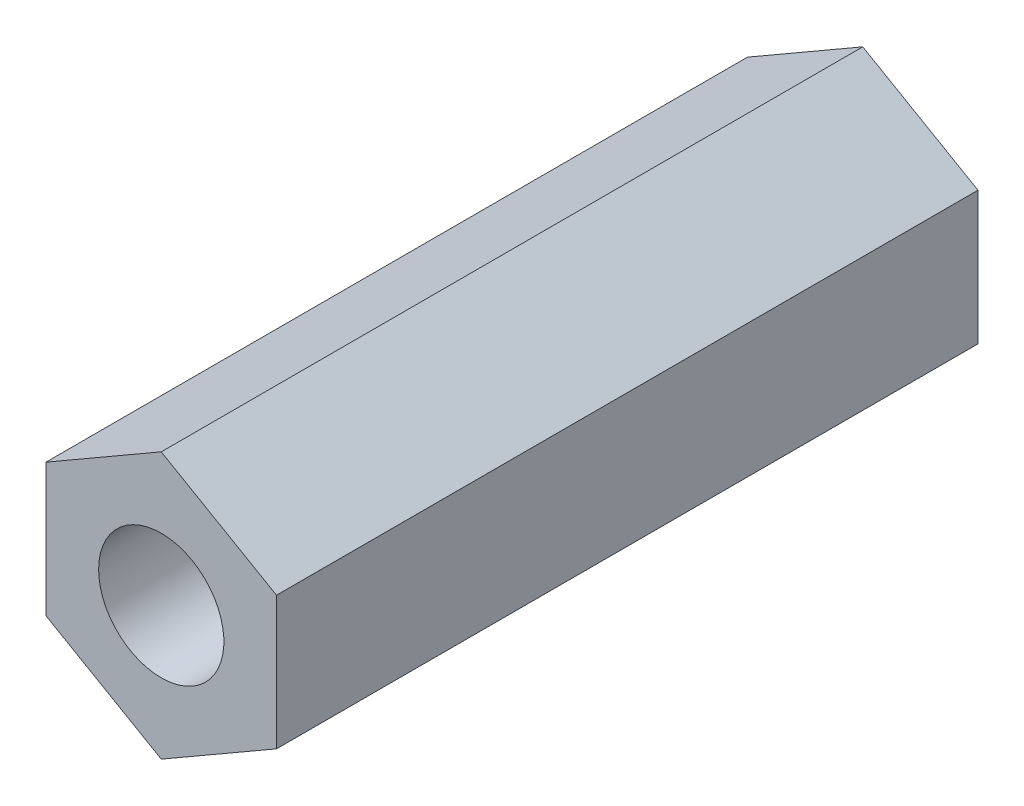
ISO-10303-21;
HEADER;
FILE_DESCRIPTION(('STEP AP214'),'2;1');
FILE_NAME('part.step','',(''),(''),'','','');
FILE_SCHEMA(('AUTOMOTIVE_DESIGN { 1 0 10303 214 1 1 1 1 }'));
ENDSEC;
DATA;
#1=APPLICATION_CONTEXT('core data for automotive mechanical design processes');
#2=APPLICATION_PROTOCOL_DEFINITION('international standard','automotive_design',2000,#1);
#3=PRODUCT_CONTEXT('',#1,'mechanical');
#4=PRODUCT('Part','Part','',(#3));
#5=PRODUCT_RELATED_PRODUCT_CATEGORY('part','',(#4));
#6=PRODUCT_DEFINITION_FORMATION('','',#4);
#7=PRODUCT_DEFINITION_CONTEXT('part definition',#1,'design');
#8=PRODUCT_DEFINITION('design','',#6,#7);
#9=PRODUCT_DEFINITION_SHAPE('','',#8);
#10=(LENGTH_UNIT() NAMED_UNIT(*) SI_UNIT(.MILLI.,.METRE.));
#11=(NAMED_UNIT(*) PLANE_ANGLE_UNIT() SI_UNIT($,.RADIAN.));
#12=(NAMED_UNIT(*) SI_UNIT($,.STERADIAN.) SOLID_ANGLE_UNIT());
#13=UNCERTAINTY_MEASURE_WITH_UNIT(LENGTH_MEASURE(1.E-05),#10,'distance_accuracy_value','');
#14=(GEOMETRIC_REPRESENTATION_CONTEXT(3) GLOBAL_UNCERTAINTY_ASSIGNED_CONTEXT((#13)) GLOBAL_UNIT_ASSIGNED_CONTEXT((#10,
#11,#12)) REPRESENTATION_CONTEXT('',''));
#15=CARTESIAN_POINT('',(0.,0.,0.));
#16=DIRECTION('',(0.,0.,1.));
#17=DIRECTION('',(1.,0.,0.));
#18=AXIS2_PLACEMENT_3D('',#15,#16,#17);
#19=CARTESIAN_POINT('',(0.,0.,15.));
#20=DIRECTION('',(0.,0.,1.));
#21=DIRECTION('',(1.,0.,0.));
#22=AXIS2_PLACEMENT_3D('',#19,#20,#21);
#23=PLANE('',#22);
#24=CARTESIAN_POINT('',(0.,0.,15.));
#25=DIRECTION('',(0.,0.,-1.));
#26=DIRECTION('',(1.,0.,0.));
#27=AXIS2_PLACEMENT_3D('',#24,#25,#26);
#28=CIRCLE('',#27,1.25);
#29=CARTESIAN_POINT('',(-1.25,0.,15.));
#30=VERTEX_POINT('',#29);
#31=EDGE_CURVE('E141',#30,#30,#28,.T.);
#32=ORIENTED_EDGE('',*,*,#31,.T.);
#33=EDGE_LOOP('',(#32));
#34=FACE_BOUND('',#33,.T.);
#35=DIRECTION('',(0.,1.,0.));
#36=VECTOR('',#35,1.);
#37=CARTESIAN_POINT('',(2.3,-1.32790561913614,15.));
#38=LINE('',#37,#36);
#39=CARTESIAN_POINT('',(2.3,-1.32790561913614,15.));
#40=VERTEX_POINT('',#39);
#41=CARTESIAN_POINT('',(2.3,1.32790561913614,15.));
#42=VERTEX_POINT('',#41);
#43=EDGE_CURVE('E91',#40,#42,#38,.T.);
#44=ORIENTED_EDGE('',*,*,#43,.T.);
#45=DIRECTION('',(-0.866025403784439,0.5,0.));
#46=VECTOR('',#45,1.);
#47=CARTESIAN_POINT('',(2.3,1.32790561913614,15.));
#48=LINE('',#47,#46);
#49=CARTESIAN_POINT('',(0.,2.65581123827228,15.));
#50=VERTEX_POINT('',#49);
#51=EDGE_CURVE('E11',#42,#50,#48,.T.);
#52=ORIENTED_EDGE('',*,*,#51,.T.);
#53=DIRECTION('',(-0.866025403784439,-0.5,0.));
#54=VECTOR('',#53,1.);
#55=CARTESIAN_POINT('',(0.,2.65581123827228,15.));
#56=LINE('',#55,#54);
#57=CARTESIAN_POINT('',(-2.3,1.32790561913614,15.));
#58=VERTEX_POINT('',#57);
#59=EDGE_CURVE('E111',#50,#58,#56,.T.);
#60=ORIENTED_EDGE('',*,*,#59,.T.);
#61=DIRECTION('',(0.,-1.,0.));
#62=VECTOR('',#61,1.);
#63=CARTESIAN_POINT('',(-2.3,1.32790561913614,15.));
#64=LINE('',#63,#62);
#65=CARTESIAN_POINT('',(-2.3,-1.32790561913614,15.));
#66=VERTEX_POINT('',#65);
#67=EDGE_CURVE('E21',#58,#66,#64,.T.);
#68=ORIENTED_EDGE('',*,*,#67,.T.);
#69=DIRECTION('',(0.866025403784439,-0.5,0.));
#70=VECTOR('',#69,1.);
#71=CARTESIAN_POINT('',(-2.3,-1.32790561913614,15.));
#72=LINE('',#71,#70);
#73=CARTESIAN_POINT('',(0.,-2.65581123827228,15.));
#74=VERTEX_POINT('',#73);
#75=EDGE_CURVE('E147',#66,#74,#72,.T.);
#76=ORIENTED_EDGE('',*,*,#75,.T.);
#77=DIRECTION('',(0.866025403784439,0.5,0.));
#78=VECTOR('',#77,1.);
#79=CARTESIAN_POINT('',(0.,-2.65581123827228,15.));
#80=LINE('',#79,#78);
#81=EDGE_CURVE('E138',#74,#40,#80,.T.);
#82=ORIENTED_EDGE('',*,*,#81,.T.);
#83=EDGE_LOOP('',(#44,#52,#60,#68,#76,#82));
#84=FACE_BOUND('',#83,.T.);
#85=ADVANCED_FACE('F17',(#34,#84),#23,.T.);
#86=CARTESIAN_POINT('',(2.3,1.32790561913614,0.));
#87=DIRECTION('',(0.5,0.866025403784439,0.));
#88=DIRECTION('',(0.,0.,-1.));
#89=AXIS2_PLACEMENT_3D('',#86,#87,#88);
#90=PLANE('',#89);
#91=DIRECTION('',(0.,0.,1.));
#92=VECTOR('',#91,1.);
#93=CARTESIAN_POINT('',(0.,2.65581123827228,0.));
#94=LINE('',#93,#92);
#95=CARTESIAN_POINT('',(0.,2.65581123827228,1.));
#96=VERTEX_POINT('',#95);
#97=EDGE_CURVE('E28',#96,#50,#94,.T.);
#98=ORIENTED_EDGE('',*,*,#97,.T.);
#99=ORIENTED_EDGE('',*,*,#51,.F.);
#100=DIRECTION('',(0.,0.,1.));
#101=VECTOR('',#100,1.);
#102=CARTESIAN_POINT('',(2.3,1.32790561913614,0.));
#103=LINE('',#102,#101);
#104=CARTESIAN_POINT('',(2.3,1.32790561913614,1.));
#105=VERTEX_POINT('',#104);
#106=EDGE_CURVE('E117',#105,#42,#103,.T.);
#107=ORIENTED_EDGE('',*,*,#106,.F.);
#108=DIRECTION('',(0.866025403784439,-0.5,0.));
#109=VECTOR('',#108,1.);
#110=CARTESIAN_POINT('',(1.725,1.65988202392017,1.));
#111=LINE('',#110,#109);
#112=EDGE_CURVE('E115',#96,#105,#111,.T.);
#113=ORIENTED_EDGE('',*,*,#112,.F.);
#114=EDGE_LOOP('',(#98,#99,#107,#113));
#115=FACE_BOUND('',#114,.T.);
#116=ADVANCED_FACE('F116',(#115),#90,.T.);
#117=CARTESIAN_POINT('',(0.,2.65581123827228,0.));
#118=DIRECTION('',(-0.5,0.866025403784439,0.));
#119=DIRECTION('',(0.,0.,1.));
#120=AXIS2_PLACEMENT_3D('',#117,#118,#119);
#121=PLANE('',#120);
#122=DIRECTION('',(0.,0.,1.));
#123=VECTOR('',#122,1.);
#124=CARTESIAN_POINT('',(-2.3,1.32790561913614,0.));
#125=LINE('',#124,#123);
#126=CARTESIAN_POINT('',(-2.3,1.32790561913614,1.));
#127=VERTEX_POINT('',#126);
#128=EDGE_CURVE('E167',#127,#58,#125,.T.);
#129=ORIENTED_EDGE('',*,*,#128,.T.);
#130=ORIENTED_EDGE('',*,*,#59,.F.);
#131=ORIENTED_EDGE('',*,*,#97,.F.);
#132=DIRECTION('',(0.866025403784439,0.5,0.));
#133=VECTOR('',#132,1.);
#134=CARTESIAN_POINT('',(-0.575,2.32383483348824,1.));
#135=LINE('',#134,#133);
#136=EDGE_CURVE('E109',#127,#96,#135,.T.);
#137=ORIENTED_EDGE('',*,*,#136,.F.);
#138=EDGE_LOOP('',(#129,#130,#131,#137));
#139=FACE_BOUND('',#138,.T.);
#140=ADVANCED_FACE('F107',(#139),#121,.T.);
#141=CARTESIAN_POINT('',(-2.3,1.32790561913614,0.));
#142=DIRECTION('',(-1.,0.,0.));
#143=DIRECTION('',(0.,0.,1.));
#144=AXIS2_PLACEMENT_3D('',#141,#142,#143);
#145=PLANE('',#144);
#146=DIRECTION('',(0.,0.,1.));
#147=VECTOR('',#146,1.);
#148=CARTESIAN_POINT('',(-2.3,-1.32790561913614,0.));
#149=LINE('',#148,#147);
#150=CARTESIAN_POINT('',(-2.3,-1.32790561913614,1.));
#151=VERTEX_POINT('',#150);
#152=EDGE_CURVE('E151',#151,#66,#149,.T.);
#153=ORIENTED_EDGE('',*,*,#152,.T.);
#154=ORIENTED_EDGE('',*,*,#67,.F.);
#155=ORIENTED_EDGE('',*,*,#128,.F.);
#156=DIRECTION('',(0.,1.,0.));
#157=VECTOR('',#156,1.);
#158=CARTESIAN_POINT('',(-2.3,0.66395280956807,1.));
#159=LINE('',#158,#157);
#160=EDGE_CURVE('E127',#151,#127,#159,.T.);
#161=ORIENTED_EDGE('',*,*,#160,.F.);
#162=EDGE_LOOP('',(#153,#154,#155,#161));
#163=FACE_BOUND('',#162,.T.);
#164=ADVANCED_FACE('F176',(#163),#145,.T.);
#165=CARTESIAN_POINT('',(0.,0.,0.));
#166=DIRECTION('',(0.,0.,1.));
#167=DIRECTION('',(1.,0.,0.));
#168=AXIS2_PLACEMENT_3D('',#165,#166,#167);
#169=CYLINDRICAL_SURFACE('',#168,1.25);
#170=ORIENTED_EDGE('',*,*,#31,.F.);
#171=DIRECTION('',(0.,0.,-1.));
#172=VECTOR('',#171,1.);
#173=CARTESIAN_POINT('',(-1.25,0.,0.));
#174=LINE('',#173,#172);
#175=CARTESIAN_POINT('',(-1.25,0.,1.));
#176=VERTEX_POINT('',#175);
#177=EDGE_CURVE('E77',#30,#176,#174,.T.);
#178=ORIENTED_EDGE('',*,*,#177,.T.);
#179=CARTESIAN_POINT('',(0.,0.,1.));
#180=DIRECTION('',(0.,0.,1.));
#181=DIRECTION('',(1.,0.,0.));
#182=AXIS2_PLACEMENT_3D('',#179,#180,#181);
#183=CIRCLE('',#182,1.25);
#184=EDGE_CURVE('E122',#176,#176,#183,.T.);
#185=ORIENTED_EDGE('',*,*,#184,.F.);
#186=ORIENTED_EDGE('',*,*,#177,.F.);
#187=EDGE_LOOP('',(#170,#178,#185,#186));
#188=FACE_BOUND('',#187,.T.);
#189=ADVANCED_FACE('F19',(#188),#169,.F.);
#190=CARTESIAN_POINT('',(2.3,-1.32790561913614,0.));
#191=DIRECTION('',(1.,0.,0.));
#192=DIRECTION('',(0.,-1.,0.));
#193=AXIS2_PLACEMENT_3D('',#190,#191,#192);
#194=PLANE('',#193);
#195=ORIENTED_EDGE('',*,*,#106,.T.);
#196=ORIENTED_EDGE('',*,*,#43,.F.);
#197=DIRECTION('',(0.,0.,1.));
#198=VECTOR('',#197,1.);
#199=CARTESIAN_POINT('',(2.3,-1.32790561913614,0.));
#200=LINE('',#199,#198);
#201=CARTESIAN_POINT('',(2.3,-1.32790561913614,1.));
#202=VERTEX_POINT('',#201);
#203=EDGE_CURVE('E160',#202,#40,#200,.T.);
#204=ORIENTED_EDGE('',*,*,#203,.F.);
#205=DIRECTION('',(0.,-1.,0.));
#206=VECTOR('',#205,1.);
#207=CARTESIAN_POINT('',(2.3,-0.663952809568071,1.));
#208=LINE('',#207,#206);
#209=EDGE_CURVE('E143',#105,#202,#208,.T.);
#210=ORIENTED_EDGE('',*,*,#209,.F.);
#211=EDGE_LOOP('',(#195,#196,#204,#210));
#212=FACE_BOUND('',#211,.T.);
#213=ADVANCED_FACE('F206',(#212),#194,.T.);
#214=CARTESIAN_POINT('',(0.,-2.65581123827228,0.));
#215=DIRECTION('',(0.5,-0.866025403784439,0.));
#216=DIRECTION('',(0.,0.,-1.));
#217=AXIS2_PLACEMENT_3D('',#214,#215,#216);
#218=PLANE('',#217);
#219=ORIENTED_EDGE('',*,*,#203,.T.);
#220=ORIENTED_EDGE('',*,*,#81,.F.);
#221=DIRECTION('',(0.,0.,1.));
#222=VECTOR('',#221,1.);
#223=CARTESIAN_POINT('',(0.,-2.65581123827228,0.));
#224=LINE('',#223,#222);
#225=CARTESIAN_POINT('',(0.,-2.65581123827228,1.));
#226=VERTEX_POINT('',#225);
#227=EDGE_CURVE('E152',#226,#74,#224,.T.);
#228=ORIENTED_EDGE('',*,*,#227,.F.);
#229=DIRECTION('',(-0.866025403784439,-0.5,0.));
#230=VECTOR('',#229,1.);
#231=CARTESIAN_POINT('',(0.575,-2.32383483348824,1.));
#232=LINE('',#231,#230);
#233=EDGE_CURVE('E146',#202,#226,#232,.T.);
#234=ORIENTED_EDGE('',*,*,#233,.F.);
#235=EDGE_LOOP('',(#219,#220,#228,#234));
#236=FACE_BOUND('',#235,.T.);
#237=ADVANCED_FACE('F197',(#236),#218,.T.);
#238=CARTESIAN_POINT('',(-2.3,-1.32790561913614,0.));
#239=DIRECTION('',(-0.5,-0.866025403784439,0.));
#240=DIRECTION('',(-0.866025403784439,0.5,0.));
#241=AXIS2_PLACEMENT_3D('',#238,#239,#240);
#242=PLANE('',#241);
#243=ORIENTED_EDGE('',*,*,#227,.T.);
#244=ORIENTED_EDGE('',*,*,#75,.F.);
#245=ORIENTED_EDGE('',*,*,#152,.F.);
#246=DIRECTION('',(-0.866025403784439,0.5,0.));
#247=VECTOR('',#246,1.);
#248=CARTESIAN_POINT('',(-1.725,-1.65988202392017,1.));
#249=LINE('',#248,#247);
#250=EDGE_CURVE('E134',#226,#151,#249,.T.);
#251=ORIENTED_EDGE('',*,*,#250,.F.);
#252=EDGE_LOOP('',(#243,#244,#245,#251));
#253=FACE_BOUND('',#252,.T.);
#254=ADVANCED_FACE('F194',(#253),#242,.T.);
#255=CARTESIAN_POINT('',(0.,0.,1.));
#256=DIRECTION('',(0.,0.,1.));
#257=DIRECTION('',(1.,0.,0.));
#258=AXIS2_PLACEMENT_3D('',#255,#256,#257);
#259=PLANE('',#258);
#260=ORIENTED_EDGE('',*,*,#184,.T.);
#261=EDGE_LOOP('',(#260));
#262=FACE_BOUND('',#261,.T.);
#263=ORIENTED_EDGE('',*,*,#209,.T.);
#264=ORIENTED_EDGE('',*,*,#233,.T.);
#265=ORIENTED_EDGE('',*,*,#250,.T.);
#266=ORIENTED_EDGE('',*,*,#160,.T.);
#267=ORIENTED_EDGE('',*,*,#136,.T.);
#268=ORIENTED_EDGE('',*,*,#112,.T.);
#269=EDGE_LOOP('',(#263,#264,#265,#266,#267,#268));
#270=FACE_BOUND('',#269,.T.);
#271=ADVANCED_FACE('F124',(#262,#270),#259,.F.);
#272=CLOSED_SHELL('',(#85,#116,#140,#164,#189,#213,#237,#254,#271));
#273=MANIFOLD_SOLID_BREP('B1',#272);
#274=ADVANCED_BREP_SHAPE_REPRESENTATION('',(#18,#273),#14);
#275=SHAPE_DEFINITION_REPRESENTATION(#9,#274);
ENDSEC;
END-ISO-10303-21;
